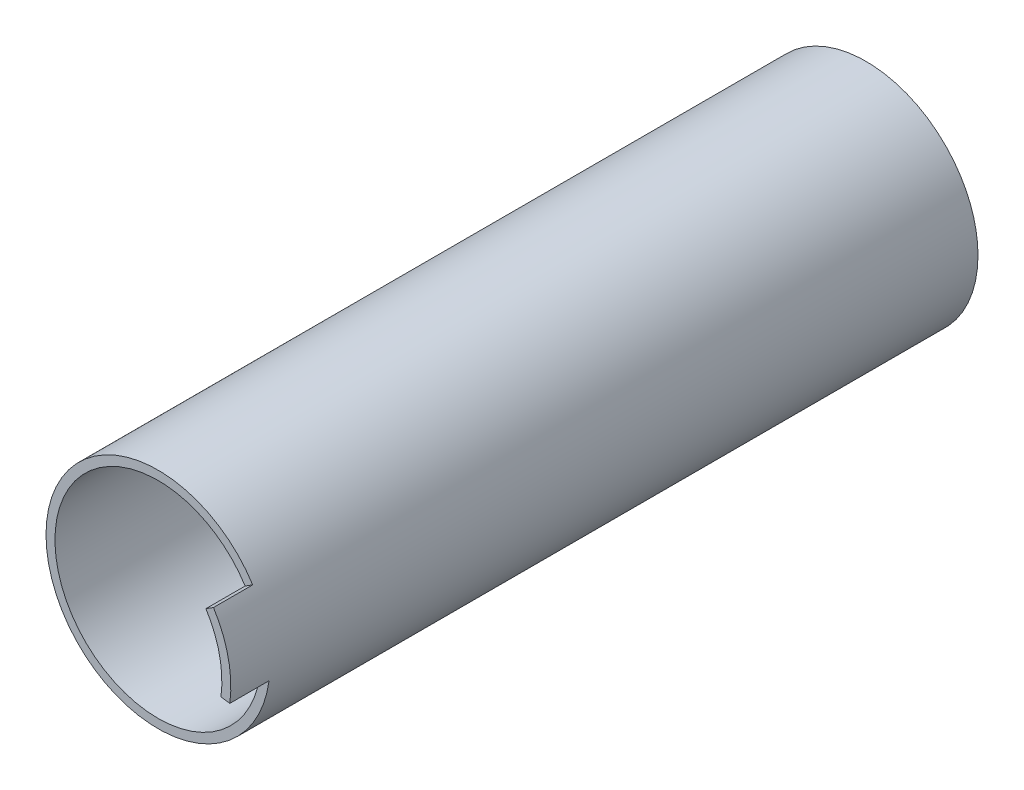
ISO-10303-21;
HEADER;
FILE_DESCRIPTION(('STEP AP214'),'2;1');
FILE_NAME('part.step','',(''),(''),'','','');
FILE_SCHEMA(('AUTOMOTIVE_DESIGN { 1 0 10303 214 1 1 1 1 }'));
ENDSEC;
DATA;
#1=APPLICATION_CONTEXT('core data for automotive mechanical design processes');
#2=APPLICATION_PROTOCOL_DEFINITION('international standard','automotive_design',2000,#1);
#3=PRODUCT_CONTEXT('',#1,'mechanical');
#4=PRODUCT('Part','Part','',(#3));
#5=PRODUCT_RELATED_PRODUCT_CATEGORY('part','',(#4));
#6=PRODUCT_DEFINITION_FORMATION('','',#4);
#7=PRODUCT_DEFINITION_CONTEXT('part definition',#1,'design');
#8=PRODUCT_DEFINITION('design','',#6,#7);
#9=PRODUCT_DEFINITION_SHAPE('','',#8);
#10=(LENGTH_UNIT() NAMED_UNIT(*) SI_UNIT(.MILLI.,.METRE.));
#11=(NAMED_UNIT(*) PLANE_ANGLE_UNIT() SI_UNIT($,.RADIAN.));
#12=(NAMED_UNIT(*) SI_UNIT($,.STERADIAN.) SOLID_ANGLE_UNIT());
#13=UNCERTAINTY_MEASURE_WITH_UNIT(LENGTH_MEASURE(1.E-05),#10,'distance_accuracy_value','');
#14=(GEOMETRIC_REPRESENTATION_CONTEXT(3) GLOBAL_UNCERTAINTY_ASSIGNED_CONTEXT((#13)) GLOBAL_UNIT_ASSIGNED_CONTEXT((#10,
#11,#12)) REPRESENTATION_CONTEXT('',''));
#15=CARTESIAN_POINT('',(0.,0.,0.));
#16=DIRECTION('',(0.,0.,1.));
#17=DIRECTION('',(1.,0.,0.));
#18=AXIS2_PLACEMENT_3D('',#15,#16,#17);
#19=CARTESIAN_POINT('',(0.,0.,0.));
#20=DIRECTION('',(0.,0.,-1.));
#21=DIRECTION('',(-1.,0.,0.));
#22=AXIS2_PLACEMENT_3D('',#19,#20,#21);
#23=PLANE('',#22);
#24=CARTESIAN_POINT('',(0.,0.,0.));
#25=DIRECTION('',(0.,0.,1.));
#26=DIRECTION('',(-1.,0.,0.));
#27=AXIS2_PLACEMENT_3D('',#24,#25,#26);
#28=CIRCLE('',#27,5.);
#29=CARTESIAN_POINT('',(-5.,0.,0.));
#30=VERTEX_POINT('',#29);
#31=CARTESIAN_POINT('',(5.,0.,0.));
#32=VERTEX_POINT('',#31);
#33=EDGE_CURVE('E110',#30,#32,#28,.T.);
#34=ORIENTED_EDGE('',*,*,#33,.F.);
#35=DIRECTION('',(0.,-1.,0.));
#36=VECTOR('',#35,1.);
#37=CARTESIAN_POINT('',(-5.,0.,0.));
#38=LINE('',#37,#36);
#39=CARTESIAN_POINT('',(-5.,16.6661333247997,0.));
#40=VERTEX_POINT('',#39);
#41=EDGE_CURVE('E64',#40,#30,#38,.T.);
#42=ORIENTED_EDGE('',*,*,#41,.F.);
#43=CARTESIAN_POINT('',(0.,0.,0.));
#44=DIRECTION('',(0.,0.,1.));
#45=DIRECTION('',(1.,0.,0.));
#46=AXIS2_PLACEMENT_3D('',#43,#44,#45);
#47=CIRCLE('',#46,17.4);
#48=CARTESIAN_POINT('',(5.,16.6661333247997,0.));
#49=VERTEX_POINT('',#48);
#50=EDGE_CURVE('E111',#49,#40,#47,.T.);
#51=ORIENTED_EDGE('',*,*,#50,.F.);
#52=DIRECTION('',(0.,1.,0.));
#53=VECTOR('',#52,1.);
#54=CARTESIAN_POINT('',(5.,0.,0.));
#55=LINE('',#54,#53);
#56=EDGE_CURVE('E100',#32,#49,#55,.T.);
#57=ORIENTED_EDGE('',*,*,#56,.F.);
#58=EDGE_LOOP('',(#34,#42,#51,#57));
#59=FACE_BOUND('',#58,.T.);
#60=CARTESIAN_POINT('',(0.,0.,0.));
#61=DIRECTION('',(0.,0.,1.));
#62=DIRECTION('',(1.,0.,0.));
#63=AXIS2_PLACEMENT_3D('',#60,#61,#62);
#64=CIRCLE('',#63,2.99999999999862);
#65=CARTESIAN_POINT('',(2.99999999999862,0.,0.));
#66=VERTEX_POINT('',#65);
#67=EDGE_CURVE('E123',#66,#66,#64,.T.);
#68=ORIENTED_EDGE('',*,*,#67,.T.);
#69=EDGE_LOOP('',(#68));
#70=FACE_BOUND('',#69,.T.);
#71=ADVANCED_FACE('F55',(#59,#70),#23,.T.);
#72=CARTESIAN_POINT('',(0.,0.,83.5307969703391));
#73=DIRECTION('',(0.,0.,-1.));
#74=DIRECTION('',(-1.,0.,0.));
#75=AXIS2_PLACEMENT_3D('',#72,#73,#74);
#76=CYLINDRICAL_SURFACE('',#75,5.);
#77=DIRECTION('',(0.,0.,-1.));
#78=VECTOR('',#77,1.);
#79=CARTESIAN_POINT('',(5.,0.,83.5307969703391));
#80=LINE('',#79,#78);
#81=CARTESIAN_POINT('',(5.,0.,58.6));
#82=VERTEX_POINT('',#81);
#83=EDGE_CURVE('E97',#82,#32,#80,.T.);
#84=ORIENTED_EDGE('',*,*,#83,.F.);
#85=CARTESIAN_POINT('',(0.,0.,58.6));
#86=DIRECTION('',(0.,0.,-1.));
#87=DIRECTION('',(-1.,0.,0.));
#88=AXIS2_PLACEMENT_3D('',#85,#86,#87);
#89=CIRCLE('',#88,5.);
#90=CARTESIAN_POINT('',(-5.,0.,58.6));
#91=VERTEX_POINT('',#90);
#92=EDGE_CURVE('E72',#82,#91,#89,.T.);
#93=ORIENTED_EDGE('',*,*,#92,.T.);
#94=DIRECTION('',(0.,0.,-1.));
#95=VECTOR('',#94,1.);
#96=CARTESIAN_POINT('',(-5.,0.,83.5307969703391));
#97=LINE('',#96,#95);
#98=EDGE_CURVE('E116',#91,#30,#97,.T.);
#99=ORIENTED_EDGE('',*,*,#98,.T.);
#100=ORIENTED_EDGE('',*,*,#33,.T.);
#101=EDGE_LOOP('',(#84,#93,#99,#100));
#102=FACE_BOUND('',#101,.T.);
#103=ADVANCED_FACE('F114',(#102),#76,.T.);
#104=CARTESIAN_POINT('',(5.,0.,83.5307969703391));
#105=DIRECTION('',(-1.,0.,0.));
#106=DIRECTION('',(0.,-1.,0.));
#107=AXIS2_PLACEMENT_3D('',#104,#105,#106);
#108=PLANE('',#107);
#109=DIRECTION('',(0.,0.,-1.));
#110=VECTOR('',#109,1.);
#111=CARTESIAN_POINT('',(5.,16.6661333247997,83.5307969703391));
#112=LINE('',#111,#110);
#113=CARTESIAN_POINT('',(5.,16.6661333247997,58.6));
#114=VERTEX_POINT('',#113);
#115=EDGE_CURVE('E92',#114,#49,#112,.T.);
#116=ORIENTED_EDGE('',*,*,#115,.F.);
#117=DIRECTION('',(0.,-1.,0.));
#118=VECTOR('',#117,1.);
#119=CARTESIAN_POINT('',(5.,0.,58.6));
#120=LINE('',#119,#118);
#121=EDGE_CURVE('E102',#114,#82,#120,.T.);
#122=ORIENTED_EDGE('',*,*,#121,.T.);
#123=ORIENTED_EDGE('',*,*,#83,.T.);
#124=ORIENTED_EDGE('',*,*,#56,.T.);
#125=EDGE_LOOP('',(#116,#122,#123,#124));
#126=FACE_BOUND('',#125,.T.);
#127=ADVANCED_FACE('F99',(#126),#108,.F.);
#128=CARTESIAN_POINT('',(0.,0.,83.5307969703391));
#129=DIRECTION('',(0.,0.,-1.));
#130=DIRECTION('',(-1.,0.,0.));
#131=AXIS2_PLACEMENT_3D('',#128,#129,#130);
#132=CYLINDRICAL_SURFACE('',#131,17.4);
#133=DIRECTION('',(0.,0.,-1.));
#134=VECTOR('',#133,1.);
#135=CARTESIAN_POINT('',(-5.,16.6661333247997,83.5307969703391));
#136=LINE('',#135,#134);
#137=CARTESIAN_POINT('',(-5.,16.6661333247997,58.6));
#138=VERTEX_POINT('',#137);
#139=EDGE_CURVE('E127',#138,#40,#136,.T.);
#140=ORIENTED_EDGE('',*,*,#139,.F.);
#141=CARTESIAN_POINT('',(0.,0.,58.6));
#142=DIRECTION('',(0.,0.,-1.));
#143=DIRECTION('',(-1.,0.,0.));
#144=AXIS2_PLACEMENT_3D('',#141,#142,#143);
#145=CIRCLE('',#144,17.4);
#146=EDGE_CURVE('E112',#138,#114,#145,.T.);
#147=ORIENTED_EDGE('',*,*,#146,.T.);
#148=ORIENTED_EDGE('',*,*,#115,.T.);
#149=ORIENTED_EDGE('',*,*,#50,.T.);
#150=EDGE_LOOP('',(#140,#147,#148,#149));
#151=FACE_BOUND('',#150,.T.);
#152=ADVANCED_FACE('F136',(#151),#132,.T.);
#153=CARTESIAN_POINT('',(-5.,0.,83.5307969703391));
#154=DIRECTION('',(1.,0.,0.));
#155=DIRECTION('',(0.,1.,0.));
#156=AXIS2_PLACEMENT_3D('',#153,#154,#155);
#157=PLANE('',#156);
#158=ORIENTED_EDGE('',*,*,#98,.F.);
#159=DIRECTION('',(0.,1.,0.));
#160=VECTOR('',#159,1.);
#161=CARTESIAN_POINT('',(-5.,0.,58.6));
#162=LINE('',#161,#160);
#163=EDGE_CURVE('E128',#91,#138,#162,.T.);
#164=ORIENTED_EDGE('',*,*,#163,.T.);
#165=ORIENTED_EDGE('',*,*,#139,.T.);
#166=ORIENTED_EDGE('',*,*,#41,.T.);
#167=EDGE_LOOP('',(#158,#164,#165,#166));
#168=FACE_BOUND('',#167,.T.);
#169=ADVANCED_FACE('F135',(#168),#157,.F.);
#170=CARTESIAN_POINT('',(0.,0.,83.5307969703391));
#171=DIRECTION('',(0.,0.,-1.));
#172=DIRECTION('',(-1.,0.,0.));
#173=AXIS2_PLACEMENT_3D('',#170,#171,#172);
#174=CYLINDRICAL_SURFACE('',#173,2.99999999999862);
#175=CARTESIAN_POINT('',(0.,0.,58.6));
#176=DIRECTION('',(0.,0.,-1.));
#177=DIRECTION('',(-1.,0.,0.));
#178=AXIS2_PLACEMENT_3D('',#175,#176,#177);
#179=CIRCLE('',#178,2.99999999999862);
#180=CARTESIAN_POINT('',(-2.99999999999862,0.,58.6));
#181=VERTEX_POINT('',#180);
#182=EDGE_CURVE('E13',#181,#181,#179,.T.);
#183=ORIENTED_EDGE('',*,*,#182,.F.);
#184=EDGE_LOOP('',(#183));
#185=FACE_BOUND('',#184,.T.);
#186=ORIENTED_EDGE('',*,*,#67,.F.);
#187=EDGE_LOOP('',(#186));
#188=FACE_BOUND('',#187,.T.);
#189=ADVANCED_FACE('F138',(#185,#188),#174,.F.);
#190=CARTESIAN_POINT('',(0.,0.,58.6));
#191=DIRECTION('',(0.,0.,-1.));
#192=DIRECTION('',(-1.,0.,0.));
#193=AXIS2_PLACEMENT_3D('',#190,#191,#192);
#194=PLANE('',#193);
#195=ORIENTED_EDGE('',*,*,#182,.T.);
#196=EDGE_LOOP('',(#195));
#197=FACE_BOUND('',#196,.T.);
#198=ORIENTED_EDGE('',*,*,#121,.F.);
#199=ORIENTED_EDGE('',*,*,#146,.F.);
#200=ORIENTED_EDGE('',*,*,#163,.F.);
#201=ORIENTED_EDGE('',*,*,#92,.F.);
#202=EDGE_LOOP('',(#198,#199,#200,#201));
#203=FACE_BOUND('',#202,.T.);
#204=ADVANCED_FACE('F57',(#197,#203),#194,.F.);
#205=CLOSED_SHELL('',(#71,#103,#127,#152,#169,#189,#204));
#206=MANIFOLD_SOLID_BREP('B2',#205);
#207=CARTESIAN_POINT('',(-7.41843380817613,8.12199728107006,126.4));
#208=DIRECTION('',(0.,0.,-1.));
#209=DIRECTION('',(-1.,0.,0.));
#210=AXIS2_PLACEMENT_3D('',#207,#208,#209);
#211=CYLINDRICAL_SURFACE('',#210,6.);
#212=CARTESIAN_POINT('',(-7.41843380817613,8.12199728107006,67.4));
#213=DIRECTION('',(0.,0.,-1.));
#214=DIRECTION('',(-1.,0.,0.));
#215=AXIS2_PLACEMENT_3D('',#212,#213,#214);
#216=CIRCLE('',#215,6.);
#217=CARTESIAN_POINT('',(-1.49818333558633,9.09700207172514,67.4));
#218=VERTEX_POINT('',#217);
#219=CARTESIAN_POINT('',(-3.37201536735278,3.69181694594094,67.4));
#220=VERTEX_POINT('',#219);
#221=EDGE_CURVE('E337',#218,#220,#216,.T.);
#222=ORIENTED_EDGE('',*,*,#221,.F.);
#223=DIRECTION('',(0.,0.,-1.));
#224=VECTOR('',#223,1.);
#225=CARTESIAN_POINT('',(-1.49818333558633,9.09700207172514,126.4));
#226=LINE('',#225,#224);
#227=CARTESIAN_POINT('',(-1.49818333558633,9.09700207172514,59.));
#228=VERTEX_POINT('',#227);
#229=EDGE_CURVE('E374',#218,#228,#226,.T.);
#230=ORIENTED_EDGE('',*,*,#229,.T.);
#231=CARTESIAN_POINT('',(-7.41843380817613,8.12199728107006,59.));
#232=DIRECTION('',(0.,0.,-1.));
#233=DIRECTION('',(-1.,0.,0.));
#234=AXIS2_PLACEMENT_3D('',#231,#232,#233);
#235=CIRCLE('',#234,6.);
#236=CARTESIAN_POINT('',(-3.37201536735278,3.69181694594094,59.));
#237=VERTEX_POINT('',#236);
#238=EDGE_CURVE('E362',#228,#237,#235,.T.);
#239=ORIENTED_EDGE('',*,*,#238,.T.);
#240=DIRECTION('',(0.,0.,-1.));
#241=VECTOR('',#240,1.);
#242=CARTESIAN_POINT('',(-3.37201536735278,3.69181694594094,126.4));
#243=LINE('',#242,#241);
#244=EDGE_CURVE('E375',#220,#237,#243,.T.);
#245=ORIENTED_EDGE('',*,*,#244,.F.);
#246=EDGE_LOOP('',(#222,#230,#239,#245));
#247=FACE_BOUND('',#246,.T.);
#248=ADVANCED_FACE('F201',(#247),#211,.F.);
#249=CARTESIAN_POINT('',(0.,0.,126.4));
#250=DIRECTION('',(0.,0.,-1.));
#251=DIRECTION('',(-1.,0.,0.));
#252=AXIS2_PLACEMENT_3D('',#249,#250,#251);
#253=CYLINDRICAL_SURFACE('',#252,5.);
#254=CARTESIAN_POINT('',(0.,0.,67.4));
#255=DIRECTION('',(0.,0.,-1.));
#256=DIRECTION('',(-1.,0.,0.));
#257=AXIS2_PLACEMENT_3D('',#254,#255,#256);
#258=CIRCLE('',#257,5.);
#259=CARTESIAN_POINT('',(2.72727272727273,4.19070202604222,67.4));
#260=VERTEX_POINT('',#259);
#261=EDGE_CURVE('E339',#220,#260,#258,.F.);
#262=ORIENTED_EDGE('',*,*,#261,.F.);
#263=ORIENTED_EDGE('',*,*,#244,.T.);
#264=CARTESIAN_POINT('',(0.,0.,59.));
#265=DIRECTION('',(0.,0.,-1.));
#266=DIRECTION('',(-1.,0.,0.));
#267=AXIS2_PLACEMENT_3D('',#264,#265,#266);
#268=CIRCLE('',#267,5.);
#269=CARTESIAN_POINT('',(2.72727272727273,4.19070202604222,59.));
#270=VERTEX_POINT('',#269);
#271=EDGE_CURVE('E365',#237,#270,#268,.F.);
#272=ORIENTED_EDGE('',*,*,#271,.T.);
#273=DIRECTION('',(0.,0.,-1.));
#274=VECTOR('',#273,1.);
#275=CARTESIAN_POINT('',(2.72727272727273,4.19070202604222,126.4));
#276=LINE('',#275,#274);
#277=EDGE_CURVE('E378',#260,#270,#276,.T.);
#278=ORIENTED_EDGE('',*,*,#277,.F.);
#279=EDGE_LOOP('',(#262,#263,#272,#278));
#280=FACE_BOUND('',#279,.T.);
#281=ADVANCED_FACE('F432',(#280),#253,.T.);
#282=CARTESIAN_POINT('',(6.,9.21954445729289,126.4));
#283=DIRECTION('',(0.,0.,-1.));
#284=DIRECTION('',(-1.,0.,0.));
#285=AXIS2_PLACEMENT_3D('',#282,#283,#284);
#286=CYLINDRICAL_SURFACE('',#285,6.);
#287=CARTESIAN_POINT('',(6.,9.21954445729289,67.4));
#288=DIRECTION('',(0.,0.,-1.));
#289=DIRECTION('',(-1.,0.,0.));
#290=AXIS2_PLACEMENT_3D('',#287,#288,#289);
#291=CIRCLE('',#290,6.);
#292=CARTESIAN_POINT('',(0.,9.21954445729289,67.4));
#293=VERTEX_POINT('',#292);
#294=EDGE_CURVE('E341',#260,#293,#291,.T.);
#295=ORIENTED_EDGE('',*,*,#294,.F.);
#296=ORIENTED_EDGE('',*,*,#277,.T.);
#297=CARTESIAN_POINT('',(6.,9.21954445729289,59.));
#298=DIRECTION('',(0.,0.,-1.));
#299=DIRECTION('',(-1.,0.,0.));
#300=AXIS2_PLACEMENT_3D('',#297,#298,#299);
#301=CIRCLE('',#300,6.);
#302=CARTESIAN_POINT('',(0.,9.21954445729289,59.));
#303=VERTEX_POINT('',#302);
#304=EDGE_CURVE('E368',#270,#303,#301,.T.);
#305=ORIENTED_EDGE('',*,*,#304,.T.);
#306=DIRECTION('',(0.,0.,-1.));
#307=VECTOR('',#306,1.);
#308=CARTESIAN_POINT('',(0.,9.21954445729289,126.4));
#309=LINE('',#308,#307);
#310=EDGE_CURVE('E380',#293,#303,#309,.T.);
#311=ORIENTED_EDGE('',*,*,#310,.F.);
#312=EDGE_LOOP('',(#295,#296,#305,#311));
#313=FACE_BOUND('',#312,.T.);
#314=ADVANCED_FACE('F434',(#313),#286,.F.);
#315=CARTESIAN_POINT('',(0.,18.4,126.4));
#316=DIRECTION('',(1.,0.,0.));
#317=DIRECTION('',(0.,1.,0.));
#318=AXIS2_PLACEMENT_3D('',#315,#316,#317);
#319=PLANE('',#318);
#320=DIRECTION('',(0.,1.,0.));
#321=VECTOR('',#320,1.);
#322=CARTESIAN_POINT('',(0.,18.4,67.4));
#323=LINE('',#322,#321);
#324=CARTESIAN_POINT('',(0.,18.4,67.4));
#325=VERTEX_POINT('',#324);
#326=EDGE_CURVE('E343',#293,#325,#323,.T.);
#327=ORIENTED_EDGE('',*,*,#326,.F.);
#328=ORIENTED_EDGE('',*,*,#310,.T.);
#329=DIRECTION('',(0.,1.,0.));
#330=VECTOR('',#329,1.);
#331=CARTESIAN_POINT('',(0.,18.4,59.));
#332=LINE('',#331,#330);
#333=CARTESIAN_POINT('',(0.,18.4,59.));
#334=VERTEX_POINT('',#333);
#335=EDGE_CURVE('E371',#303,#334,#332,.T.);
#336=ORIENTED_EDGE('',*,*,#335,.T.);
#337=DIRECTION('',(0.,0.,-1.));
#338=VECTOR('',#337,1.);
#339=CARTESIAN_POINT('',(0.,18.4,126.4));
#340=LINE('',#339,#338);
#341=EDGE_CURVE('E382',#325,#334,#340,.T.);
#342=ORIENTED_EDGE('',*,*,#341,.F.);
#343=EDGE_LOOP('',(#327,#328,#336,#342));
#344=FACE_BOUND('',#343,.T.);
#345=ADVANCED_FACE('F440',(#344),#319,.T.);
#346=CARTESIAN_POINT('',(-2.99001469134222,18.1554347826087,126.4));
#347=DIRECTION('',(-0.986708412098299,-0.162500798442512,0.));
#348=DIRECTION('',(0.162500798442512,-0.986708412098299,0.));
#349=AXIS2_PLACEMENT_3D('',#346,#347,#348);
#350=PLANE('',#349);
#351=DIRECTION('',(0.162500798442512,-0.986708412098299,0.));
#352=VECTOR('',#351,1.);
#353=CARTESIAN_POINT('',(-2.99001469134222,18.1554347826087,67.4));
#354=LINE('',#353,#352);
#355=CARTESIAN_POINT('',(-2.99001469134222,18.1554347826087,67.4));
#356=VERTEX_POINT('',#355);
#357=EDGE_CURVE('E335',#356,#218,#354,.T.);
#358=ORIENTED_EDGE('',*,*,#357,.F.);
#359=DIRECTION('',(0.,0.,-1.));
#360=VECTOR('',#359,1.);
#361=CARTESIAN_POINT('',(-2.99001469134222,18.1554347826087,126.4));
#362=LINE('',#361,#360);
#363=CARTESIAN_POINT('',(-2.99001469134222,18.1554347826087,59.));
#364=VERTEX_POINT('',#363);
#365=EDGE_CURVE('E386',#356,#364,#362,.T.);
#366=ORIENTED_EDGE('',*,*,#365,.T.);
#367=DIRECTION('',(0.162500798442512,-0.986708412098299,0.));
#368=VECTOR('',#367,1.);
#369=CARTESIAN_POINT('',(-2.99001469134222,18.1554347826087,59.));
#370=LINE('',#369,#368);
#371=EDGE_CURVE('E359',#364,#228,#370,.T.);
#372=ORIENTED_EDGE('',*,*,#371,.T.);
#373=ORIENTED_EDGE('',*,*,#229,.F.);
#374=EDGE_LOOP('',(#358,#366,#372,#373));
#375=FACE_BOUND('',#374,.T.);
#376=ADVANCED_FACE('F414',(#375),#350,.T.);
#377=CARTESIAN_POINT('',(0.,0.,126.4));
#378=DIRECTION('',(0.,0.,-1.));
#379=DIRECTION('',(-1.,0.,0.));
#380=AXIS2_PLACEMENT_3D('',#377,#378,#379);
#381=CYLINDRICAL_SURFACE('',#380,3.);
#382=CARTESIAN_POINT('',(0.,0.,67.4));
#383=DIRECTION('',(0.,0.,-1.));
#384=DIRECTION('',(-1.,0.,0.));
#385=AXIS2_PLACEMENT_3D('',#382,#383,#384);
#386=CIRCLE('',#385,3.);
#387=CARTESIAN_POINT('',(-3.,0.,67.4));
#388=VERTEX_POINT('',#387);
#389=EDGE_CURVE('E332',#388,#388,#386,.F.);
#390=ORIENTED_EDGE('',*,*,#389,.T.);
#391=EDGE_LOOP('',(#390));
#392=FACE_BOUND('',#391,.T.);
#393=CARTESIAN_POINT('',(0.,0.,59.));
#394=DIRECTION('',(0.,0.,-1.));
#395=DIRECTION('',(-1.,0.,0.));
#396=AXIS2_PLACEMENT_3D('',#393,#394,#395);
#397=CIRCLE('',#396,3.);
#398=CARTESIAN_POINT('',(-3.,0.,59.));
#399=VERTEX_POINT('',#398);
#400=EDGE_CURVE('E205',#399,#399,#397,.F.);
#401=ORIENTED_EDGE('',*,*,#400,.F.);
#402=EDGE_LOOP('',(#401));
#403=FACE_BOUND('',#402,.T.);
#404=ADVANCED_FACE('F477',(#392,#403),#381,.F.);
#405=CARTESIAN_POINT('',(0.,0.,126.4));
#406=DIRECTION('',(0.,0.,1.));
#407=DIRECTION('',(1.,0.,0.));
#408=AXIS2_PLACEMENT_3D('',#405,#406,#407);
#409=PLANE('',#408);
#410=DIRECTION('',(0.991029909341494,-0.133640258869064,0.));
#411=VECTOR('',#410,1.);
#412=CARTESIAN_POINT('',(19.8205981868299,-2.6728051773813,126.4));
#413=LINE('',#412,#411);
#414=CARTESIAN_POINT('',(18.2349503318835,-2.4589807631908,126.4));
#415=VERTEX_POINT('',#414);
#416=CARTESIAN_POINT('',(19.8205981868299,-2.6728051773813,126.4));
#417=VERTEX_POINT('',#416);
#418=EDGE_CURVE('E314',#415,#417,#413,.T.);
#419=ORIENTED_EDGE('',*,*,#418,.F.);
#420=CARTESIAN_POINT('',(0.,0.,126.4));
#421=DIRECTION('',(0.,0.,1.));
#422=DIRECTION('',(1.,0.,0.));
#423=AXIS2_PLACEMENT_3D('',#420,#421,#422);
#424=CIRCLE('',#423,18.4);
#425=CARTESIAN_POINT('',(-2.99001469134222,18.1554347826087,126.4));
#426=VERTEX_POINT('',#425);
#427=EDGE_CURVE('E388',#426,#415,#424,.T.);
#428=ORIENTED_EDGE('',*,*,#427,.F.);
#429=DIRECTION('',(-0.995176312080905,-0.0981025375464324,0.));
#430=VECTOR('',#429,1.);
#431=CARTESIAN_POINT('',(-0.61254331601909,18.3898012682574,126.4));
#432=LINE('',#431,#430);
#433=CARTESIAN_POINT('',(-0.61254331601909,18.3898012682574,126.4));
#434=VERTEX_POINT('',#433);
#435=EDGE_CURVE('E317',#434,#426,#432,.T.);
#436=ORIENTED_EDGE('',*,*,#435,.F.);
#437=CARTESIAN_POINT('',(15.5493847393265,9.83751158720541,126.4));
#438=VERTEX_POINT('',#437);
#439=EDGE_CURVE('E391',#438,#434,#424,.T.);
#440=ORIENTED_EDGE('',*,*,#439,.F.);
#441=DIRECTION('',(-0.845075257572091,-0.53464736886986,0.));
#442=VECTOR('',#441,1.);
#443=CARTESIAN_POINT('',(16.9015051514418,10.6929473773972,126.4));
#444=LINE('',#443,#442);
#445=CARTESIAN_POINT('',(16.9015051514418,10.6929473773972,126.4));
#446=VERTEX_POINT('',#445);
#447=EDGE_CURVE('E222',#446,#438,#444,.T.);
#448=ORIENTED_EDGE('',*,*,#447,.F.);
#449=CARTESIAN_POINT('',(0.,0.,126.4));
#450=DIRECTION('',(0.,0.,1.));
#451=DIRECTION('',(1.,0.,0.));
#452=AXIS2_PLACEMENT_3D('',#449,#450,#451);
#453=CIRCLE('',#452,20.);
#454=EDGE_CURVE('E53',#446,#417,#453,.T.);
#455=ORIENTED_EDGE('',*,*,#454,.T.);
#456=EDGE_LOOP('',(#419,#428,#436,#440,#448,#455));
#457=FACE_BOUND('',#456,.T.);
#458=ADVANCED_FACE('F398',(#457),#409,.T.);
#459=CARTESIAN_POINT('',(0.,0.,0.));
#460=DIRECTION('',(0.,0.,1.));
#461=DIRECTION('',(1.,0.,0.));
#462=AXIS2_PLACEMENT_3D('',#459,#460,#461);
#463=PLANE('',#462);
#464=CARTESIAN_POINT('',(0.,0.,0.));
#465=DIRECTION('',(0.,0.,1.));
#466=DIRECTION('',(1.,0.,0.));
#467=AXIS2_PLACEMENT_3D('',#464,#465,#466);
#468=CIRCLE('',#467,20.);
#469=CARTESIAN_POINT('',(20.,0.,0.));
#470=VERTEX_POINT('',#469);
#471=EDGE_CURVE('E211',#470,#470,#468,.T.);
#472=ORIENTED_EDGE('',*,*,#471,.F.);
#473=EDGE_LOOP('',(#472));
#474=FACE_BOUND('',#473,.T.);
#475=CARTESIAN_POINT('',(0.,0.,0.));
#476=DIRECTION('',(0.,0.,1.));
#477=DIRECTION('',(1.,0.,0.));
#478=AXIS2_PLACEMENT_3D('',#475,#476,#477);
#479=CIRCLE('',#478,18.4);
#480=CARTESIAN_POINT('',(-2.99001469134222,18.1554347826087,0.));
#481=VERTEX_POINT('',#480);
#482=CARTESIAN_POINT('',(-0.612543111063199,18.3898012750842,0.));
#483=VERTEX_POINT('',#482);
#484=EDGE_CURVE('E377',#481,#483,#479,.T.);
#485=ORIENTED_EDGE('',*,*,#484,.T.);
#486=DIRECTION('',(0.995176312627585,0.0981025320007712,0.));
#487=VECTOR('',#486,1.);
#488=CARTESIAN_POINT('',(-0.612543111063199,18.3898012750842,0.));
#489=LINE('',#488,#487);
#490=EDGE_CURVE('E345',#481,#483,#489,.T.);
#491=ORIENTED_EDGE('',*,*,#490,.F.);
#492=EDGE_LOOP('',(#485,#491));
#493=FACE_BOUND('',#492,.T.);
#494=ADVANCED_FACE('F395',(#474,#493),#463,.F.);
#495=CARTESIAN_POINT('',(0.,0.,126.4));
#496=DIRECTION('',(0.,0.,-1.));
#497=DIRECTION('',(-1.,0.,0.));
#498=AXIS2_PLACEMENT_3D('',#495,#496,#497);
#499=CYLINDRICAL_SURFACE('',#498,20.);
#500=ORIENTED_EDGE('',*,*,#454,.F.);
#501=DIRECTION('',(0.,0.,-1.));
#502=VECTOR('',#501,1.);
#503=CARTESIAN_POINT('',(16.9015051514418,10.6929473773972,133.4));
#504=LINE('',#503,#502);
#505=CARTESIAN_POINT('',(16.9015051514418,10.6929473773972,133.4));
#506=VERTEX_POINT('',#505);
#507=EDGE_CURVE('E299',#506,#446,#504,.T.);
#508=ORIENTED_EDGE('',*,*,#507,.F.);
#509=CARTESIAN_POINT('',(0.,0.,133.4));
#510=DIRECTION('',(0.,0.,1.));
#511=DIRECTION('',(-1.,0.,0.));
#512=AXIS2_PLACEMENT_3D('',#509,#510,#511);
#513=CIRCLE('',#512,20.);
#514=CARTESIAN_POINT('',(19.8205981868299,-2.6728051773813,133.4));
#515=VERTEX_POINT('',#514);
#516=EDGE_CURVE('E305',#515,#506,#513,.T.);
#517=ORIENTED_EDGE('',*,*,#516,.F.);
#518=DIRECTION('',(0.,0.,-1.));
#519=VECTOR('',#518,1.);
#520=CARTESIAN_POINT('',(19.8205981868299,-2.6728051773813,133.4));
#521=LINE('',#520,#519);
#522=EDGE_CURVE('E451',#515,#417,#521,.T.);
#523=ORIENTED_EDGE('',*,*,#522,.T.);
#524=EDGE_LOOP('',(#500,#508,#517,#523));
#525=FACE_BOUND('',#524,.T.);
#526=ORIENTED_EDGE('',*,*,#471,.T.);
#527=EDGE_LOOP('',(#526));
#528=FACE_BOUND('',#527,.T.);
#529=ADVANCED_FACE('F203',(#525,#528),#499,.T.);
#530=CARTESIAN_POINT('',(0.,0.,126.4));
#531=DIRECTION('',(0.,0.,-1.));
#532=DIRECTION('',(-1.,0.,0.));
#533=AXIS2_PLACEMENT_3D('',#530,#531,#532);
#534=CYLINDRICAL_SURFACE('',#533,18.4);
#535=ORIENTED_EDGE('',*,*,#365,.F.);
#536=EDGE_CURVE('E384',#426,#356,#362,.T.);
#537=ORIENTED_EDGE('',*,*,#536,.F.);
#538=ORIENTED_EDGE('',*,*,#427,.T.);
#539=DIRECTION('',(0.,0.,-1.));
#540=VECTOR('',#539,1.);
#541=CARTESIAN_POINT('',(18.2349503318835,-2.4589807631908,133.4));
#542=LINE('',#541,#540);
#543=CARTESIAN_POINT('',(18.2349503318835,-2.4589807631908,133.4));
#544=VERTEX_POINT('',#543);
#545=EDGE_CURVE('E321',#544,#415,#542,.T.);
#546=ORIENTED_EDGE('',*,*,#545,.F.);
#547=CARTESIAN_POINT('',(0.,0.,133.4));
#548=DIRECTION('',(0.,0.,-1.));
#549=DIRECTION('',(-1.,0.,0.));
#550=AXIS2_PLACEMENT_3D('',#547,#548,#549);
#551=CIRCLE('',#550,18.4);
#552=CARTESIAN_POINT('',(15.5493847393265,9.83751158720541,133.4));
#553=VERTEX_POINT('',#552);
#554=EDGE_CURVE('E304',#553,#544,#551,.T.);
#555=ORIENTED_EDGE('',*,*,#554,.F.);
#556=DIRECTION('',(0.,0.,-1.));
#557=VECTOR('',#556,1.);
#558=CARTESIAN_POINT('',(15.5493847393265,9.83751158720541,133.4));
#559=LINE('',#558,#557);
#560=EDGE_CURVE('E301',#553,#438,#559,.T.);
#561=ORIENTED_EDGE('',*,*,#560,.T.);
#562=ORIENTED_EDGE('',*,*,#439,.T.);
#563=DIRECTION('',(0.,0.,1.));
#564=VECTOR('',#563,1.);
#565=CARTESIAN_POINT('',(-0.61254331601909,18.3898012682574,67.4));
#566=LINE('',#565,#564);
#567=CARTESIAN_POINT('',(-0.61254331601909,18.3898012682574,67.4));
#568=VERTEX_POINT('',#567);
#569=EDGE_CURVE('E328',#568,#434,#566,.T.);
#570=ORIENTED_EDGE('',*,*,#569,.F.);
#571=CARTESIAN_POINT('',(0.,0.,67.4));
#572=DIRECTION('',(0.,0.,1.));
#573=DIRECTION('',(-1.,0.,0.));
#574=AXIS2_PLACEMENT_3D('',#571,#572,#573);
#575=CIRCLE('',#574,18.4);
#576=EDGE_CURVE('E319',#325,#568,#575,.T.);
#577=ORIENTED_EDGE('',*,*,#576,.F.);
#578=ORIENTED_EDGE('',*,*,#341,.T.);
#579=CARTESIAN_POINT('',(0.,0.,59.));
#580=DIRECTION('',(0.,0.,-1.));
#581=DIRECTION('',(-1.,0.,0.));
#582=AXIS2_PLACEMENT_3D('',#579,#580,#581);
#583=CIRCLE('',#582,18.4);
#584=CARTESIAN_POINT('',(-0.612543111063199,18.3898012750842,59.));
#585=VERTEX_POINT('',#584);
#586=EDGE_CURVE('E346',#585,#334,#583,.T.);
#587=ORIENTED_EDGE('',*,*,#586,.F.);
#588=DIRECTION('',(0.,0.,-1.));
#589=VECTOR('',#588,1.);
#590=CARTESIAN_POINT('',(-0.612543111063199,18.3898012750842,59.));
#591=LINE('',#590,#589);
#592=EDGE_CURVE('E355',#585,#483,#591,.T.);
#593=ORIENTED_EDGE('',*,*,#592,.T.);
#594=ORIENTED_EDGE('',*,*,#484,.F.);
#595=DIRECTION('',(0.,0.,-1.));
#596=VECTOR('',#595,1.);
#597=CARTESIAN_POINT('',(-2.99001469134222,18.1554347826087,59.));
#598=LINE('',#597,#596);
#599=EDGE_CURVE('E352',#364,#481,#598,.T.);
#600=ORIENTED_EDGE('',*,*,#599,.F.);
#601=EDGE_LOOP('',(#535,#537,#538,#546,#555,#561,#562,#570,#577,#578,#587,#593,#594,#600));
#602=FACE_BOUND('',#601,.T.);
#603=ADVANCED_FACE('F405',(#602),#534,.F.);
#604=CARTESIAN_POINT('',(0.,0.,59.));
#605=DIRECTION('',(0.,0.,-1.));
#606=DIRECTION('',(-1.,0.,0.));
#607=AXIS2_PLACEMENT_3D('',#604,#605,#606);
#608=PLANE('',#607);
#609=ORIENTED_EDGE('',*,*,#304,.F.);
#610=ORIENTED_EDGE('',*,*,#271,.F.);
#611=ORIENTED_EDGE('',*,*,#238,.F.);
#612=ORIENTED_EDGE('',*,*,#371,.F.);
#613=DIRECTION('',(0.995176312627585,0.0981025320007712,0.));
#614=VECTOR('',#613,1.);
#615=CARTESIAN_POINT('',(-0.612543111063199,18.3898012750842,59.));
#616=LINE('',#615,#614);
#617=EDGE_CURVE('E349',#364,#585,#616,.T.);
#618=ORIENTED_EDGE('',*,*,#617,.T.);
#619=ORIENTED_EDGE('',*,*,#586,.T.);
#620=ORIENTED_EDGE('',*,*,#335,.F.);
#621=EDGE_LOOP('',(#609,#610,#611,#612,#618,#619,#620));
#622=FACE_BOUND('',#621,.T.);
#623=ORIENTED_EDGE('',*,*,#400,.T.);
#624=EDGE_LOOP('',(#623));
#625=FACE_BOUND('',#624,.T.);
#626=ADVANCED_FACE('F419',(#622,#625),#608,.T.);
#627=CARTESIAN_POINT('',(-0.612543111063199,18.3898012750842,59.));
#628=DIRECTION('',(-0.0981025320007713,0.995176312627586,0.));
#629=DIRECTION('',(-0.995176312627586,-0.0981025320007713,0.));
#630=AXIS2_PLACEMENT_3D('',#627,#628,#629);
#631=PLANE('',#630);
#632=ORIENTED_EDGE('',*,*,#490,.T.);
#633=ORIENTED_EDGE('',*,*,#592,.F.);
#634=ORIENTED_EDGE('',*,*,#617,.F.);
#635=ORIENTED_EDGE('',*,*,#599,.T.);
#636=EDGE_LOOP('',(#632,#633,#634,#635));
#637=FACE_BOUND('',#636,.T.);
#638=ADVANCED_FACE('F408',(#637),#631,.F.);
#639=CARTESIAN_POINT('',(0.,0.,67.4));
#640=DIRECTION('',(0.,0.,-1.));
#641=DIRECTION('',(-1.,0.,0.));
#642=AXIS2_PLACEMENT_3D('',#639,#640,#641);
#643=PLANE('',#642);
#644=ORIENTED_EDGE('',*,*,#326,.T.);
#645=ORIENTED_EDGE('',*,*,#576,.T.);
#646=DIRECTION('',(-0.995176312080905,-0.0981025375464324,0.));
#647=VECTOR('',#646,1.);
#648=CARTESIAN_POINT('',(-0.61254331601909,18.3898012682574,67.4));
#649=LINE('',#648,#647);
#650=EDGE_CURVE('E326',#568,#356,#649,.T.);
#651=ORIENTED_EDGE('',*,*,#650,.T.);
#652=ORIENTED_EDGE('',*,*,#357,.T.);
#653=ORIENTED_EDGE('',*,*,#221,.T.);
#654=ORIENTED_EDGE('',*,*,#261,.T.);
#655=ORIENTED_EDGE('',*,*,#294,.T.);
#656=EDGE_LOOP('',(#644,#645,#651,#652,#653,#654,#655));
#657=FACE_BOUND('',#656,.T.);
#658=ORIENTED_EDGE('',*,*,#389,.F.);
#659=EDGE_LOOP('',(#658));
#660=FACE_BOUND('',#659,.T.);
#661=ADVANCED_FACE('F427',(#657,#660),#643,.F.);
#662=CARTESIAN_POINT('',(-0.61254331601909,18.3898012682574,67.4));
#663=DIRECTION('',(-0.0981025375464324,0.995176312080905,0.));
#664=DIRECTION('',(-0.995176312080905,-0.0981025375464324,0.));
#665=AXIS2_PLACEMENT_3D('',#662,#663,#664);
#666=PLANE('',#665);
#667=ORIENTED_EDGE('',*,*,#435,.T.);
#668=ORIENTED_EDGE('',*,*,#536,.T.);
#669=ORIENTED_EDGE('',*,*,#650,.F.);
#670=ORIENTED_EDGE('',*,*,#569,.T.);
#671=EDGE_LOOP('',(#667,#668,#669,#670));
#672=FACE_BOUND('',#671,.T.);
#673=ADVANCED_FACE('F446',(#672),#666,.F.);
#674=CARTESIAN_POINT('',(16.9015051514418,10.6929473773972,133.4));
#675=DIRECTION('',(0.53464736886986,-0.845075257572091,0.));
#676=DIRECTION('',(0.845075257572091,0.534647368869861,0.));
#677=AXIS2_PLACEMENT_3D('',#674,#675,#676);
#678=PLANE('',#677);
#679=ORIENTED_EDGE('',*,*,#447,.T.);
#680=ORIENTED_EDGE('',*,*,#560,.F.);
#681=DIRECTION('',(-0.845075257572091,-0.53464736886986,0.));
#682=VECTOR('',#681,1.);
#683=CARTESIAN_POINT('',(16.9015051514418,10.6929473773972,133.4));
#684=LINE('',#683,#682);
#685=EDGE_CURVE('E295',#506,#553,#684,.T.);
#686=ORIENTED_EDGE('',*,*,#685,.F.);
#687=ORIENTED_EDGE('',*,*,#507,.T.);
#688=EDGE_LOOP('',(#679,#680,#686,#687));
#689=FACE_BOUND('',#688,.T.);
#690=ADVANCED_FACE('F297',(#689),#678,.F.);
#691=CARTESIAN_POINT('',(19.8205981868299,-2.6728051773813,133.4));
#692=DIRECTION('',(0.133640258869064,0.991029909341494,0.));
#693=DIRECTION('',(-0.991029909341494,0.133640258869064,0.));
#694=AXIS2_PLACEMENT_3D('',#691,#692,#693);
#695=PLANE('',#694);
#696=ORIENTED_EDGE('',*,*,#418,.T.);
#697=ORIENTED_EDGE('',*,*,#522,.F.);
#698=DIRECTION('',(0.991029909341494,-0.133640258869064,0.));
#699=VECTOR('',#698,1.);
#700=CARTESIAN_POINT('',(19.8205981868299,-2.6728051773813,133.4));
#701=LINE('',#700,#699);
#702=EDGE_CURVE('E310',#544,#515,#701,.T.);
#703=ORIENTED_EDGE('',*,*,#702,.F.);
#704=ORIENTED_EDGE('',*,*,#545,.T.);
#705=EDGE_LOOP('',(#696,#697,#703,#704));
#706=FACE_BOUND('',#705,.T.);
#707=ADVANCED_FACE('F450',(#706),#695,.F.);
#708=CARTESIAN_POINT('',(0.,0.,133.4));
#709=DIRECTION('',(0.,0.,-1.));
#710=DIRECTION('',(-1.,0.,0.));
#711=AXIS2_PLACEMENT_3D('',#708,#709,#710);
#712=PLANE('',#711);
#713=ORIENTED_EDGE('',*,*,#516,.T.);
#714=ORIENTED_EDGE('',*,*,#685,.T.);
#715=ORIENTED_EDGE('',*,*,#554,.T.);
#716=ORIENTED_EDGE('',*,*,#702,.T.);
#717=EDGE_LOOP('',(#713,#714,#715,#716));
#718=FACE_BOUND('',#717,.T.);
#719=ADVANCED_FACE('F308',(#718),#712,.F.);
#720=CLOSED_SHELL('',(#248,#281,#314,#345,#376,#404,#458,#494,#529,#603,#626,#638,#661,#673,
#690,#707,#719));
#721=MANIFOLD_SOLID_BREP('B7',#720);
#722=ADVANCED_BREP_SHAPE_REPRESENTATION('',(#18,#206,#721),#14);
#723=SHAPE_DEFINITION_REPRESENTATION(#9,#722);
ENDSEC;
END-ISO-10303-21;
